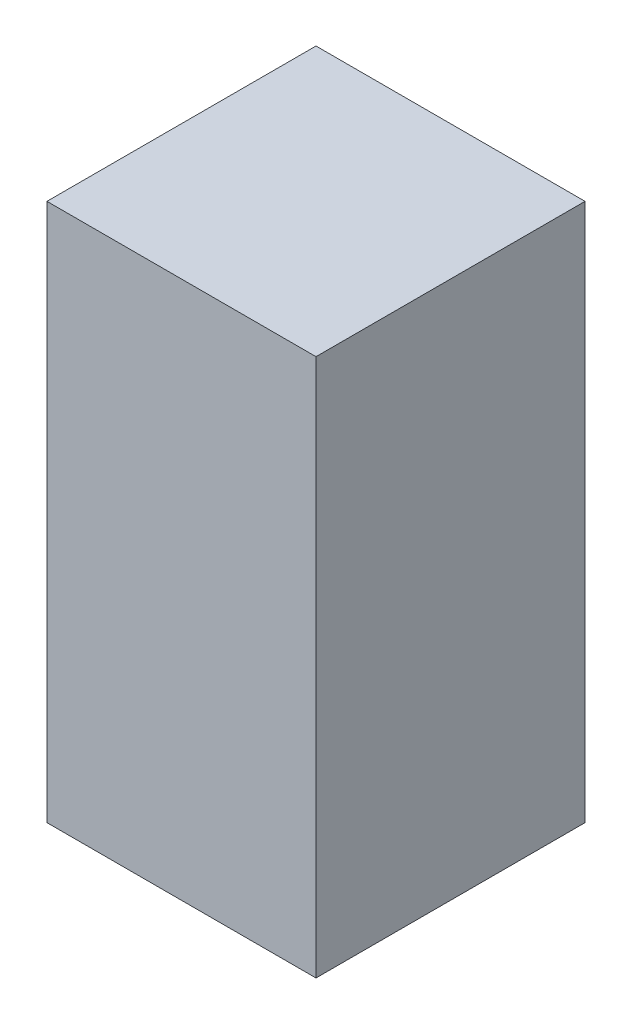
ISO-10303-21;
HEADER;
FILE_DESCRIPTION(('STEP AP214'),'2;1');
FILE_NAME('part.step','',(''),(''),'','','');
FILE_SCHEMA(('AUTOMOTIVE_DESIGN { 1 0 10303 214 1 1 1 1 }'));
ENDSEC;
DATA;
#1=APPLICATION_CONTEXT('core data for automotive mechanical design processes');
#2=APPLICATION_PROTOCOL_DEFINITION('international standard','automotive_design',2000,#1);
#3=PRODUCT_CONTEXT('',#1,'mechanical');
#4=PRODUCT('Part','Part','',(#3));
#5=PRODUCT_RELATED_PRODUCT_CATEGORY('part','',(#4));
#6=PRODUCT_DEFINITION_FORMATION('','',#4);
#7=PRODUCT_DEFINITION_CONTEXT('part definition',#1,'design');
#8=PRODUCT_DEFINITION('design','',#6,#7);
#9=PRODUCT_DEFINITION_SHAPE('','',#8);
#10=(LENGTH_UNIT() NAMED_UNIT(*) SI_UNIT(.MILLI.,.METRE.));
#11=(NAMED_UNIT(*) PLANE_ANGLE_UNIT() SI_UNIT($,.RADIAN.));
#12=(NAMED_UNIT(*) SI_UNIT($,.STERADIAN.) SOLID_ANGLE_UNIT());
#13=UNCERTAINTY_MEASURE_WITH_UNIT(LENGTH_MEASURE(1.E-05),#10,'distance_accuracy_value','');
#14=(GEOMETRIC_REPRESENTATION_CONTEXT(3) GLOBAL_UNCERTAINTY_ASSIGNED_CONTEXT((#13)) GLOBAL_UNIT_ASSIGNED_CONTEXT((#10,
#11,#12)) REPRESENTATION_CONTEXT('',''));
#15=CARTESIAN_POINT('',(0.,0.,0.));
#16=DIRECTION('',(0.,0.,1.));
#17=DIRECTION('',(1.,0.,0.));
#18=AXIS2_PLACEMENT_3D('',#15,#16,#17);
#19=CARTESIAN_POINT('',(0.,100.,0.));
#20=DIRECTION('',(-1.,0.,0.));
#21=DIRECTION('',(0.,0.,1.));
#22=AXIS2_PLACEMENT_3D('',#19,#20,#21);
#23=PLANE('',#22);
#24=DIRECTION('',(0.,0.,-1.));
#25=VECTOR('',#24,1.);
#26=CARTESIAN_POINT('',(0.,0.,0.));
#27=LINE('',#26,#25);
#28=CARTESIAN_POINT('',(0.,0.,0.));
#29=VERTEX_POINT('',#28);
#30=CARTESIAN_POINT('',(0.,0.,-50.));
#31=VERTEX_POINT('',#30);
#32=EDGE_CURVE('E104',#29,#31,#27,.T.);
#33=ORIENTED_EDGE('',*,*,#32,.F.);
#34=DIRECTION('',(0.,-1.,0.));
#35=VECTOR('',#34,1.);
#36=CARTESIAN_POINT('',(0.,100.,0.));
#37=LINE('',#36,#35);
#38=CARTESIAN_POINT('',(0.,100.,0.));
#39=VERTEX_POINT('',#38);
#40=EDGE_CURVE('E11',#39,#29,#37,.T.);
#41=ORIENTED_EDGE('',*,*,#40,.F.);
#42=DIRECTION('',(0.,0.,-1.));
#43=VECTOR('',#42,1.);
#44=CARTESIAN_POINT('',(0.,100.,0.));
#45=LINE('',#44,#43);
#46=CARTESIAN_POINT('',(0.,100.,-50.));
#47=VERTEX_POINT('',#46);
#48=EDGE_CURVE('E99',#39,#47,#45,.T.);
#49=ORIENTED_EDGE('',*,*,#48,.T.);
#50=DIRECTION('',(0.,-1.,0.));
#51=VECTOR('',#50,1.);
#52=CARTESIAN_POINT('',(0.,100.,-50.));
#53=LINE('',#52,#51);
#54=EDGE_CURVE('E42',#47,#31,#53,.T.);
#55=ORIENTED_EDGE('',*,*,#54,.T.);
#56=EDGE_LOOP('',(#33,#41,#49,#55));
#57=FACE_BOUND('',#56,.T.);
#58=ADVANCED_FACE('F39',(#57),#23,.T.);
#59=CARTESIAN_POINT('',(0.,100.,0.));
#60=DIRECTION('',(0.,0.,-1.));
#61=DIRECTION('',(-1.,0.,0.));
#62=AXIS2_PLACEMENT_3D('',#59,#60,#61);
#63=PLANE('',#62);
#64=DIRECTION('',(1.,0.,0.));
#65=VECTOR('',#64,1.);
#66=CARTESIAN_POINT('',(0.,0.,0.));
#67=LINE('',#66,#65);
#68=CARTESIAN_POINT('',(50.,0.,0.));
#69=VERTEX_POINT('',#68);
#70=EDGE_CURVE('E72',#29,#69,#67,.T.);
#71=ORIENTED_EDGE('',*,*,#70,.T.);
#72=DIRECTION('',(0.,-1.,0.));
#73=VECTOR('',#72,1.);
#74=CARTESIAN_POINT('',(50.,100.,0.));
#75=LINE('',#74,#73);
#76=CARTESIAN_POINT('',(50.,100.,0.));
#77=VERTEX_POINT('',#76);
#78=EDGE_CURVE('E48',#77,#69,#75,.T.);
#79=ORIENTED_EDGE('',*,*,#78,.F.);
#80=DIRECTION('',(1.,0.,0.));
#81=VECTOR('',#80,1.);
#82=CARTESIAN_POINT('',(0.,100.,0.));
#83=LINE('',#82,#81);
#84=EDGE_CURVE('E89',#39,#77,#83,.T.);
#85=ORIENTED_EDGE('',*,*,#84,.F.);
#86=ORIENTED_EDGE('',*,*,#40,.T.);
#87=EDGE_LOOP('',(#71,#79,#85,#86));
#88=FACE_BOUND('',#87,.T.);
#89=ADVANCED_FACE('F115',(#88),#63,.F.);
#90=CARTESIAN_POINT('',(50.,100.,0.));
#91=DIRECTION('',(-1.,0.,0.));
#92=DIRECTION('',(0.,0.,1.));
#93=AXIS2_PLACEMENT_3D('',#90,#91,#92);
#94=PLANE('',#93);
#95=DIRECTION('',(0.,0.,-1.));
#96=VECTOR('',#95,1.);
#97=CARTESIAN_POINT('',(50.,0.,0.));
#98=LINE('',#97,#96);
#99=CARTESIAN_POINT('',(50.,0.,-50.));
#100=VERTEX_POINT('',#99);
#101=EDGE_CURVE('E96',#69,#100,#98,.T.);
#102=ORIENTED_EDGE('',*,*,#101,.T.);
#103=DIRECTION('',(0.,-1.,0.));
#104=VECTOR('',#103,1.);
#105=CARTESIAN_POINT('',(50.,100.,-50.));
#106=LINE('',#105,#104);
#107=CARTESIAN_POINT('',(50.,100.,-50.));
#108=VERTEX_POINT('',#107);
#109=EDGE_CURVE('E93',#108,#100,#106,.T.);
#110=ORIENTED_EDGE('',*,*,#109,.F.);
#111=DIRECTION('',(0.,0.,-1.));
#112=VECTOR('',#111,1.);
#113=CARTESIAN_POINT('',(50.,100.,0.));
#114=LINE('',#113,#112);
#115=EDGE_CURVE('E84',#77,#108,#114,.T.);
#116=ORIENTED_EDGE('',*,*,#115,.F.);
#117=ORIENTED_EDGE('',*,*,#78,.T.);
#118=EDGE_LOOP('',(#102,#110,#116,#117));
#119=FACE_BOUND('',#118,.T.);
#120=ADVANCED_FACE('F94',(#119),#94,.F.);
#121=CARTESIAN_POINT('',(0.,100.,-50.));
#122=DIRECTION('',(0.,0.,-1.));
#123=DIRECTION('',(-1.,0.,0.));
#124=AXIS2_PLACEMENT_3D('',#121,#122,#123);
#125=PLANE('',#124);
#126=DIRECTION('',(1.,0.,0.));
#127=VECTOR('',#126,1.);
#128=CARTESIAN_POINT('',(0.,0.,-50.));
#129=LINE('',#128,#127);
#130=EDGE_CURVE('E107',#31,#100,#129,.T.);
#131=ORIENTED_EDGE('',*,*,#130,.F.);
#132=ORIENTED_EDGE('',*,*,#54,.F.);
#133=DIRECTION('',(1.,0.,0.));
#134=VECTOR('',#133,1.);
#135=CARTESIAN_POINT('',(0.,100.,-50.));
#136=LINE('',#135,#134);
#137=EDGE_CURVE('E88',#47,#108,#136,.T.);
#138=ORIENTED_EDGE('',*,*,#137,.T.);
#139=ORIENTED_EDGE('',*,*,#109,.T.);
#140=EDGE_LOOP('',(#131,#132,#138,#139));
#141=FACE_BOUND('',#140,.T.);
#142=ADVANCED_FACE('F98',(#141),#125,.T.);
#143=CARTESIAN_POINT('',(0.,100.,0.));
#144=DIRECTION('',(0.,-1.,0.));
#145=DIRECTION('',(0.,0.,-1.));
#146=AXIS2_PLACEMENT_3D('',#143,#144,#145);
#147=PLANE('',#146);
#148=ORIENTED_EDGE('',*,*,#48,.F.);
#149=ORIENTED_EDGE('',*,*,#84,.T.);
#150=ORIENTED_EDGE('',*,*,#115,.T.);
#151=ORIENTED_EDGE('',*,*,#137,.F.);
#152=EDGE_LOOP('',(#148,#149,#150,#151));
#153=FACE_BOUND('',#152,.T.);
#154=ADVANCED_FACE('F87',(#153),#147,.F.);
#155=CARTESIAN_POINT('',(0.,0.,0.));
#156=DIRECTION('',(0.,-1.,0.));
#157=DIRECTION('',(0.,0.,-1.));
#158=AXIS2_PLACEMENT_3D('',#155,#156,#157);
#159=PLANE('',#158);
#160=ORIENTED_EDGE('',*,*,#32,.T.);
#161=ORIENTED_EDGE('',*,*,#130,.T.);
#162=ORIENTED_EDGE('',*,*,#101,.F.);
#163=ORIENTED_EDGE('',*,*,#70,.F.);
#164=EDGE_LOOP('',(#160,#161,#162,#163));
#165=FACE_BOUND('',#164,.T.);
#166=ADVANCED_FACE('F112',(#165),#159,.T.);
#167=CLOSED_SHELL('',(#58,#89,#120,#142,#154,#166));
#168=MANIFOLD_SOLID_BREP('B2',#167);
#169=ADVANCED_BREP_SHAPE_REPRESENTATION('',(#18,#168),#14);
#170=SHAPE_DEFINITION_REPRESENTATION(#9,#169);
ENDSEC;
END-ISO-10303-21;
